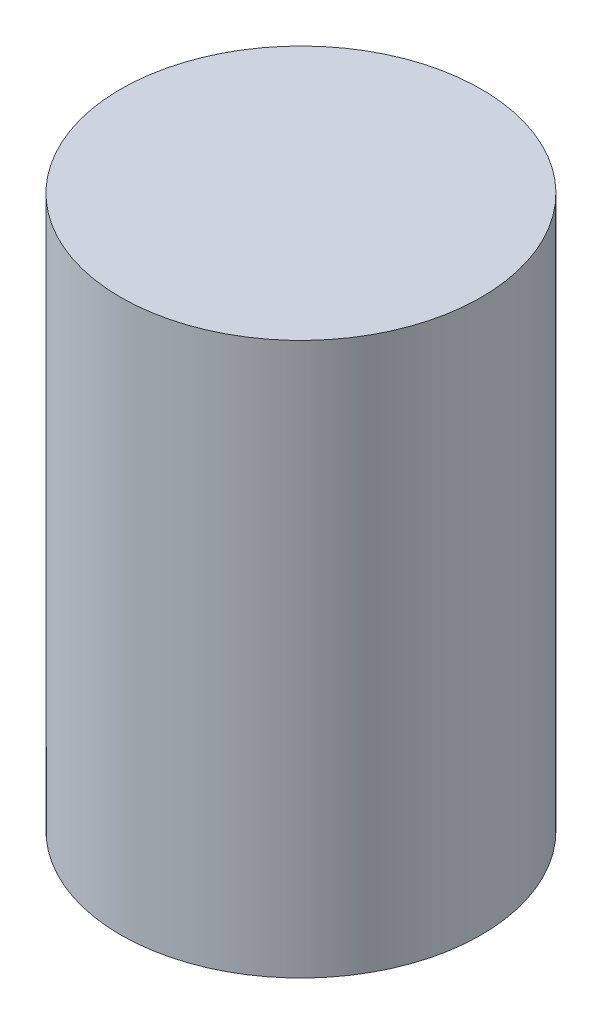
ISO-10303-21;
HEADER;
FILE_DESCRIPTION(('STEP AP214'),'2;1');
FILE_NAME('part.step','',(''),(''),'','','');
FILE_SCHEMA(('AUTOMOTIVE_DESIGN { 1 0 10303 214 1 1 1 1 }'));
ENDSEC;
DATA;
#1=APPLICATION_CONTEXT('core data for automotive mechanical design processes');
#2=APPLICATION_PROTOCOL_DEFINITION('international standard','automotive_design',2000,#1);
#3=PRODUCT_CONTEXT('',#1,'mechanical');
#4=PRODUCT('Part','Part','',(#3));
#5=PRODUCT_RELATED_PRODUCT_CATEGORY('part','',(#4));
#6=PRODUCT_DEFINITION_FORMATION('','',#4);
#7=PRODUCT_DEFINITION_CONTEXT('part definition',#1,'design');
#8=PRODUCT_DEFINITION('design','',#6,#7);
#9=PRODUCT_DEFINITION_SHAPE('','',#8);
#10=(LENGTH_UNIT() NAMED_UNIT(*) SI_UNIT(.MILLI.,.METRE.));
#11=(NAMED_UNIT(*) PLANE_ANGLE_UNIT() SI_UNIT($,.RADIAN.));
#12=(NAMED_UNIT(*) SI_UNIT($,.STERADIAN.) SOLID_ANGLE_UNIT());
#13=UNCERTAINTY_MEASURE_WITH_UNIT(LENGTH_MEASURE(1.E-05),#10,'distance_accuracy_value','');
#14=(GEOMETRIC_REPRESENTATION_CONTEXT(3) GLOBAL_UNCERTAINTY_ASSIGNED_CONTEXT((#13)) GLOBAL_UNIT_ASSIGNED_CONTEXT((#10,
#11,#12)) REPRESENTATION_CONTEXT('',''));
#15=CARTESIAN_POINT('',(0.,0.,0.));
#16=DIRECTION('',(0.,0.,1.));
#17=DIRECTION('',(1.,0.,0.));
#18=AXIS2_PLACEMENT_3D('',#15,#16,#17);
#19=CARTESIAN_POINT('',(0.,12.446,0.));
#20=DIRECTION('',(0.,-1.,0.));
#21=DIRECTION('',(0.,0.,-1.));
#22=AXIS2_PLACEMENT_3D('',#19,#20,#21);
#23=CYLINDRICAL_SURFACE('',#22,4.064);
#24=CARTESIAN_POINT('',(0.,12.446,0.));
#25=DIRECTION('',(0.,1.,0.));
#26=DIRECTION('',(0.,0.,1.));
#27=AXIS2_PLACEMENT_3D('',#24,#25,#26);
#28=CIRCLE('',#27,4.064);
#29=CARTESIAN_POINT('',(0.,12.446,4.064));
#30=VERTEX_POINT('',#29);
#31=EDGE_CURVE('E10',#30,#30,#28,.T.);
#32=ORIENTED_EDGE('',*,*,#31,.F.);
#33=EDGE_LOOP('',(#32));
#34=FACE_BOUND('',#33,.T.);
#35=CARTESIAN_POINT('',(0.,0.,0.));
#36=DIRECTION('',(0.,1.,0.));
#37=DIRECTION('',(0.,0.,1.));
#38=AXIS2_PLACEMENT_3D('',#35,#36,#37);
#39=CIRCLE('',#38,4.064);
#40=CARTESIAN_POINT('',(0.,0.,4.064));
#41=VERTEX_POINT('',#40);
#42=EDGE_CURVE('E34',#41,#41,#39,.T.);
#43=ORIENTED_EDGE('',*,*,#42,.T.);
#44=EDGE_LOOP('',(#43));
#45=FACE_BOUND('',#44,.T.);
#46=ADVANCED_FACE('F31',(#34,#45),#23,.T.);
#47=CARTESIAN_POINT('',(0.,12.446,0.));
#48=DIRECTION('',(0.,1.,0.));
#49=DIRECTION('',(0.,0.,1.));
#50=AXIS2_PLACEMENT_3D('',#47,#48,#49);
#51=PLANE('',#50);
#52=ORIENTED_EDGE('',*,*,#31,.T.);
#53=EDGE_LOOP('',(#52));
#54=FACE_BOUND('',#53,.T.);
#55=ADVANCED_FACE('F46',(#54),#51,.T.);
#56=CARTESIAN_POINT('',(0.,0.,0.));
#57=DIRECTION('',(0.,1.,0.));
#58=DIRECTION('',(0.,0.,1.));
#59=AXIS2_PLACEMENT_3D('',#56,#57,#58);
#60=PLANE('',#59);
#61=ORIENTED_EDGE('',*,*,#42,.F.);
#62=EDGE_LOOP('',(#61));
#63=FACE_BOUND('',#62,.T.);
#64=ADVANCED_FACE('F44',(#63),#60,.F.);
#65=CLOSED_SHELL('',(#46,#55,#64));
#66=MANIFOLD_SOLID_BREP('B2',#65);
#67=ADVANCED_BREP_SHAPE_REPRESENTATION('',(#18,#66),#14);
#68=SHAPE_DEFINITION_REPRESENTATION(#9,#67);
ENDSEC;
END-ISO-10303-21;
